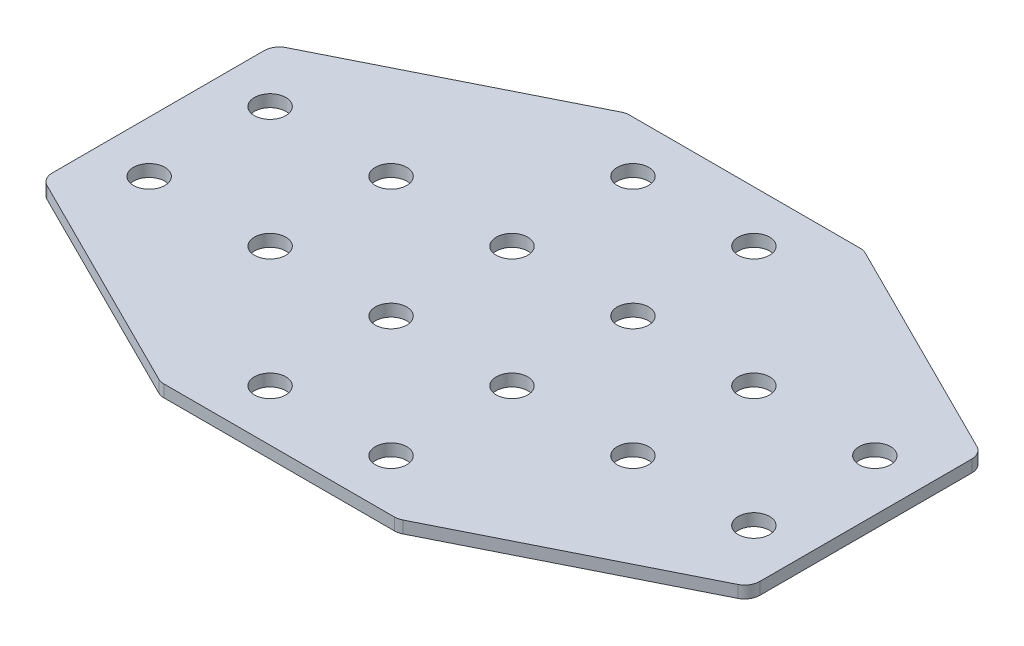
ISO-10303-21;
HEADER;
FILE_DESCRIPTION(('STEP AP214'),'2;1');
FILE_NAME('part.step','',(''),(''),'','','');
FILE_SCHEMA(('AUTOMOTIVE_DESIGN { 1 0 10303 214 1 1 1 1 }'));
ENDSEC;
DATA;
#1=APPLICATION_CONTEXT('core data for automotive mechanical design processes');
#2=APPLICATION_PROTOCOL_DEFINITION('international standard','automotive_design',2000,#1);
#3=PRODUCT_CONTEXT('',#1,'mechanical');
#4=PRODUCT('Part','Part','',(#3));
#5=PRODUCT_RELATED_PRODUCT_CATEGORY('part','',(#4));
#6=PRODUCT_DEFINITION_FORMATION('','',#4);
#7=PRODUCT_DEFINITION_CONTEXT('part definition',#1,'design');
#8=PRODUCT_DEFINITION('design','',#6,#7);
#9=PRODUCT_DEFINITION_SHAPE('','',#8);
#10=(LENGTH_UNIT() NAMED_UNIT(*) SI_UNIT(.MILLI.,.METRE.));
#11=(NAMED_UNIT(*) PLANE_ANGLE_UNIT() SI_UNIT($,.RADIAN.));
#12=(NAMED_UNIT(*) SI_UNIT($,.STERADIAN.) SOLID_ANGLE_UNIT());
#13=UNCERTAINTY_MEASURE_WITH_UNIT(LENGTH_MEASURE(1.E-05),#10,'distance_accuracy_value','');
#14=(GEOMETRIC_REPRESENTATION_CONTEXT(3) GLOBAL_UNCERTAINTY_ASSIGNED_CONTEXT((#13)) GLOBAL_UNIT_ASSIGNED_CONTEXT((#10,
#11,#12)) REPRESENTATION_CONTEXT('',''));
#15=CARTESIAN_POINT('',(0.,0.,0.));
#16=DIRECTION('',(0.,0.,1.));
#17=DIRECTION('',(1.,0.,0.));
#18=AXIS2_PLACEMENT_3D('',#15,#16,#17);
#19=CARTESIAN_POINT('',(-1.85772119630201,2.14126526069458,-1.28303356234483));
#20=DIRECTION('',(0.,-1.,0.));
#21=DIRECTION('',(0.,0.,-1.));
#22=AXIS2_PLACEMENT_3D('',#19,#20,#21);
#23=PLANE('',#22);
#24=CARTESIAN_POINT('',(-11.857721196302,2.14126526069458,8.71696643765519));
#25=DIRECTION('',(0.,-1.,0.));
#26=DIRECTION('',(0.,0.,1.));
#27=AXIS2_PLACEMENT_3D('',#24,#25,#26);
#28=CIRCLE('',#27,2.6);
#29=CARTESIAN_POINT('',(-11.857721196302,2.14126526069458,11.3169664376552));
#30=VERTEX_POINT('',#29);
#31=EDGE_CURVE('E140',#30,#30,#28,.T.);
#32=ORIENTED_EDGE('',*,*,#31,.F.);
#33=EDGE_LOOP('',(#32));
#34=FACE_BOUND('',#33,.T.);
#35=CARTESIAN_POINT('',(-11.857721196302,2.14126526069458,28.7169664376552));
#36=DIRECTION('',(0.,-1.,0.));
#37=DIRECTION('',(0.,0.,1.));
#38=AXIS2_PLACEMENT_3D('',#35,#36,#37);
#39=CIRCLE('',#38,2.6);
#40=CARTESIAN_POINT('',(-11.857721196302,2.14126526069458,31.3169664376552));
#41=VERTEX_POINT('',#40);
#42=EDGE_CURVE('E243',#41,#41,#39,.T.);
#43=ORIENTED_EDGE('',*,*,#42,.F.);
#44=EDGE_LOOP('',(#43));
#45=FACE_BOUND('',#44,.T.);
#46=CARTESIAN_POINT('',(-31.857721196302,2.14126526069458,8.71696643765519));
#47=DIRECTION('',(0.,-1.,0.));
#48=DIRECTION('',(0.,0.,1.));
#49=AXIS2_PLACEMENT_3D('',#46,#47,#48);
#50=CIRCLE('',#49,2.6);
#51=CARTESIAN_POINT('',(-31.857721196302,2.14126526069458,11.3169664376552));
#52=VERTEX_POINT('',#51);
#53=EDGE_CURVE('E237',#52,#52,#50,.T.);
#54=ORIENTED_EDGE('',*,*,#53,.F.);
#55=EDGE_LOOP('',(#54));
#56=FACE_BOUND('',#55,.T.);
#57=CARTESIAN_POINT('',(-51.857721196302,2.14126526069458,8.71696643765517));
#58=DIRECTION('',(0.,-1.,0.));
#59=DIRECTION('',(0.,0.,1.));
#60=AXIS2_PLACEMENT_3D('',#57,#58,#59);
#61=CIRCLE('',#60,2.6);
#62=CARTESIAN_POINT('',(-51.857721196302,2.14126526069458,11.3169664376552));
#63=VERTEX_POINT('',#62);
#64=EDGE_CURVE('E231',#63,#63,#61,.T.);
#65=ORIENTED_EDGE('',*,*,#64,.F.);
#66=EDGE_LOOP('',(#65));
#67=FACE_BOUND('',#66,.T.);
#68=CARTESIAN_POINT('',(8.14227880369796,2.14126526069458,8.71696643765518));
#69=DIRECTION('',(0.,1.,0.));
#70=DIRECTION('',(0.,0.,1.));
#71=AXIS2_PLACEMENT_3D('',#68,#69,#70);
#72=CIRCLE('',#71,2.6);
#73=CARTESIAN_POINT('',(8.14227880369796,2.14126526069458,11.3169664376552));
#74=VERTEX_POINT('',#73);
#75=EDGE_CURVE('E298',#74,#74,#72,.T.);
#76=ORIENTED_EDGE('',*,*,#75,.T.);
#77=EDGE_LOOP('',(#76));
#78=FACE_BOUND('',#77,.T.);
#79=CARTESIAN_POINT('',(8.142278803698,2.14126526069458,28.7169664376552));
#80=DIRECTION('',(0.,1.,0.));
#81=DIRECTION('',(0.,0.,1.));
#82=AXIS2_PLACEMENT_3D('',#79,#80,#81);
#83=CIRCLE('',#82,2.6);
#84=CARTESIAN_POINT('',(8.142278803698,2.14126526069458,31.3169664376552));
#85=VERTEX_POINT('',#84);
#86=EDGE_CURVE('E292',#85,#85,#83,.T.);
#87=ORIENTED_EDGE('',*,*,#86,.T.);
#88=EDGE_LOOP('',(#87));
#89=FACE_BOUND('',#88,.T.);
#90=CARTESIAN_POINT('',(28.142278803698,2.14126526069458,8.71696643765519));
#91=DIRECTION('',(0.,1.,0.));
#92=DIRECTION('',(0.,0.,1.));
#93=AXIS2_PLACEMENT_3D('',#90,#91,#92);
#94=CIRCLE('',#93,2.6);
#95=CARTESIAN_POINT('',(28.142278803698,2.14126526069458,11.3169664376552));
#96=VERTEX_POINT('',#95);
#97=EDGE_CURVE('E286',#96,#96,#94,.T.);
#98=ORIENTED_EDGE('',*,*,#97,.T.);
#99=EDGE_LOOP('',(#98));
#100=FACE_BOUND('',#99,.T.);
#101=CARTESIAN_POINT('',(48.142278803698,2.14126526069458,8.71696643765516));
#102=DIRECTION('',(0.,1.,0.));
#103=DIRECTION('',(0.,0.,1.));
#104=AXIS2_PLACEMENT_3D('',#101,#102,#103);
#105=CIRCLE('',#104,2.6);
#106=CARTESIAN_POINT('',(48.142278803698,2.14126526069458,11.3169664376552));
#107=VERTEX_POINT('',#106);
#108=EDGE_CURVE('E280',#107,#107,#105,.T.);
#109=ORIENTED_EDGE('',*,*,#108,.T.);
#110=EDGE_LOOP('',(#109));
#111=FACE_BOUND('',#110,.T.);
#112=DIRECTION('',(0.,0.,-1.));
#113=VECTOR('',#112,1.);
#114=CARTESIAN_POINT('',(-60.3577211963019,2.14126526069458,17.7899154545304));
#115=LINE('',#114,#113);
#116=CARTESIAN_POINT('',(-60.3577211963019,2.14126526069458,16.2448304826556));
#117=VERTEX_POINT('',#116);
#118=CARTESIAN_POINT('',(-60.3577211963019,2.14126526069458,-18.8108976073453));
#119=VERTEX_POINT('',#118);
#120=EDGE_CURVE('E253',#117,#119,#115,.T.);
#121=ORIENTED_EDGE('',*,*,#120,.T.);
#122=CARTESIAN_POINT('',(-57.8577211963019,2.14126526069458,-18.8108976073453));
#123=DIRECTION('',(0.,-1.,0.));
#124=DIRECTION('',(0.,0.,1.));
#125=AXIS2_PLACEMENT_3D('',#122,#123,#124);
#126=CIRCLE('',#125,2.5);
#127=CARTESIAN_POINT('',(-58.9757551850518,2.14126526069458,-21.0469655848451));
#128=VERTEX_POINT('',#127);
#129=EDGE_CURVE('E148',#119,#128,#126,.T.);
#130=ORIENTED_EDGE('',*,*,#129,.T.);
#131=DIRECTION('',(-0.894427190999916,0.,0.447213595499957));
#132=VECTOR('',#131,1.);
#133=CARTESIAN_POINT('',(-21.5036192300524,2.14126526069458,-39.7830335623448));
#134=LINE('',#133,#132);
#135=CARTESIAN_POINT('',(-22.0314832750528,2.14126526069458,-39.5191015398446));
#136=VERTEX_POINT('',#135);
#137=EDGE_CURVE('E158',#136,#128,#134,.T.);
#138=ORIENTED_EDGE('',*,*,#137,.F.);
#139=CARTESIAN_POINT('',(-20.9134492863029,2.14126526069458,-37.2830335623448));
#140=DIRECTION('',(0.,-1.,0.));
#141=DIRECTION('',(0.,0.,1.));
#142=AXIS2_PLACEMENT_3D('',#139,#140,#141);
#143=CIRCLE('',#142,2.5);
#144=CARTESIAN_POINT('',(-20.9134492863029,2.14126526069458,-39.7830335623448));
#145=VERTEX_POINT('',#144);
#146=EDGE_CURVE('E168',#136,#145,#143,.T.);
#147=ORIENTED_EDGE('',*,*,#146,.T.);
#148=DIRECTION('',(1.,0.,0.));
#149=VECTOR('',#148,1.);
#150=CARTESIAN_POINT('',(-20.3577211963021,2.14126526069458,-39.7830335623448));
#151=LINE('',#150,#149);
#152=CARTESIAN_POINT('',(17.1980068936989,2.14126526069458,-39.7830335623448));
#153=VERTEX_POINT('',#152);
#154=EDGE_CURVE('E198',#145,#153,#151,.T.);
#155=ORIENTED_EDGE('',*,*,#154,.T.);
#156=CARTESIAN_POINT('',(17.1980068936989,2.14126526069458,-37.2830335623448));
#157=DIRECTION('',(0.,1.,0.));
#158=DIRECTION('',(0.,0.,1.));
#159=AXIS2_PLACEMENT_3D('',#156,#157,#158);
#160=CIRCLE('',#159,2.5);
#161=CARTESIAN_POINT('',(18.3160408824488,2.14126526069458,-39.5191015398446));
#162=VERTEX_POINT('',#161);
#163=EDGE_CURVE('E220',#162,#153,#160,.T.);
#164=ORIENTED_EDGE('',*,*,#163,.F.);
#165=DIRECTION('',(0.894427190999916,0.,0.447213595499957));
#166=VECTOR('',#165,1.);
#167=CARTESIAN_POINT('',(17.7881768374484,2.14126526069458,-39.7830335623448));
#168=LINE('',#167,#166);
#169=CARTESIAN_POINT('',(55.2603127924478,2.14126526069458,-21.0469655848451));
#170=VERTEX_POINT('',#169);
#171=EDGE_CURVE('E201',#162,#170,#168,.T.);
#172=ORIENTED_EDGE('',*,*,#171,.T.);
#173=CARTESIAN_POINT('',(54.1422788036979,2.14126526069458,-18.8108976073453));
#174=DIRECTION('',(0.,1.,0.));
#175=DIRECTION('',(0.,0.,1.));
#176=AXIS2_PLACEMENT_3D('',#173,#174,#175);
#177=CIRCLE('',#176,2.5);
#178=CARTESIAN_POINT('',(56.6422788036979,2.14126526069458,-18.8108976073453));
#179=VERTEX_POINT('',#178);
#180=EDGE_CURVE('E217',#179,#170,#177,.T.);
#181=ORIENTED_EDGE('',*,*,#180,.F.);
#182=DIRECTION('',(0.,0.,-1.));
#183=VECTOR('',#182,1.);
#184=CARTESIAN_POINT('',(56.6422788036979,2.14126526069458,17.7899154545304));
#185=LINE('',#184,#183);
#186=CARTESIAN_POINT('',(56.6422788036979,2.14126526069458,16.2448304826556));
#187=VERTEX_POINT('',#186);
#188=EDGE_CURVE('E304',#187,#179,#185,.T.);
#189=ORIENTED_EDGE('',*,*,#188,.F.);
#190=CARTESIAN_POINT('',(54.1422788036979,2.14126526069458,16.2448304826556));
#191=DIRECTION('',(0.,-1.,0.));
#192=DIRECTION('',(0.,0.,-1.));
#193=AXIS2_PLACEMENT_3D('',#190,#191,#192);
#194=CIRCLE('',#193,2.5);
#195=CARTESIAN_POINT('',(55.2603127924478,2.14126526069458,18.4808984601554));
#196=VERTEX_POINT('',#195);
#197=EDGE_CURVE('E31',#187,#196,#194,.T.);
#198=ORIENTED_EDGE('',*,*,#197,.T.);
#199=DIRECTION('',(0.894427190999916,0.,-0.447213595499957));
#200=VECTOR('',#199,1.);
#201=CARTESIAN_POINT('',(17.7881768374484,2.14126526069458,37.2169664376551));
#202=LINE('',#201,#200);
#203=CARTESIAN_POINT('',(18.3160408824488,2.14126526069458,36.9530344151549));
#204=VERTEX_POINT('',#203);
#205=EDGE_CURVE('E309',#204,#196,#202,.T.);
#206=ORIENTED_EDGE('',*,*,#205,.F.);
#207=CARTESIAN_POINT('',(17.1980068936989,2.14126526069458,34.7169664376551));
#208=DIRECTION('',(0.,-1.,0.));
#209=DIRECTION('',(0.,0.,-1.));
#210=AXIS2_PLACEMENT_3D('',#207,#208,#209);
#211=CIRCLE('',#210,2.5);
#212=CARTESIAN_POINT('',(17.1980068936989,2.14126526069458,37.2169664376551));
#213=VERTEX_POINT('',#212);
#214=EDGE_CURVE('E324',#204,#213,#211,.T.);
#215=ORIENTED_EDGE('',*,*,#214,.T.);
#216=DIRECTION('',(1.,0.,0.));
#217=VECTOR('',#216,1.);
#218=CARTESIAN_POINT('',(-20.3577211963021,2.14126526069458,37.2169664376551));
#219=LINE('',#218,#217);
#220=CARTESIAN_POINT('',(-20.9134492863029,2.14126526069458,37.2169664376551));
#221=VERTEX_POINT('',#220);
#222=EDGE_CURVE('E306',#221,#213,#219,.T.);
#223=ORIENTED_EDGE('',*,*,#222,.F.);
#224=CARTESIAN_POINT('',(-20.9134492863029,2.14126526069458,34.7169664376551));
#225=DIRECTION('',(0.,1.,0.));
#226=DIRECTION('',(0.,0.,-1.));
#227=AXIS2_PLACEMENT_3D('',#224,#225,#226);
#228=CIRCLE('',#227,2.5);
#229=CARTESIAN_POINT('',(-22.0314832750528,2.14126526069458,36.9530344151549));
#230=VERTEX_POINT('',#229);
#231=EDGE_CURVE('E270',#230,#221,#228,.T.);
#232=ORIENTED_EDGE('',*,*,#231,.F.);
#233=DIRECTION('',(-0.894427190999916,0.,-0.447213595499957));
#234=VECTOR('',#233,1.);
#235=CARTESIAN_POINT('',(-21.5036192300524,2.14126526069458,37.2169664376551));
#236=LINE('',#235,#234);
#237=CARTESIAN_POINT('',(-58.9757551850518,2.14126526069458,18.4808984601554));
#238=VERTEX_POINT('',#237);
#239=EDGE_CURVE('E255',#230,#238,#236,.T.);
#240=ORIENTED_EDGE('',*,*,#239,.T.);
#241=CARTESIAN_POINT('',(-57.8577211963019,2.14126526069458,16.2448304826556));
#242=DIRECTION('',(0.,1.,0.));
#243=DIRECTION('',(0.,0.,-1.));
#244=AXIS2_PLACEMENT_3D('',#241,#242,#243);
#245=CIRCLE('',#244,2.5);
#246=EDGE_CURVE('E267',#117,#238,#245,.T.);
#247=ORIENTED_EDGE('',*,*,#246,.F.);
#248=EDGE_LOOP('',(#121,#130,#138,#147,#155,#164,#172,#181,#189,#198,#206,#215,#223,#232,#240,#247));
#249=FACE_BOUND('',#248,.T.);
#250=CARTESIAN_POINT('',(-11.857721196302,2.14126526069458,-11.2830335623448));
#251=DIRECTION('',(0.,1.,0.));
#252=DIRECTION('',(0.,0.,-1.));
#253=AXIS2_PLACEMENT_3D('',#250,#251,#252);
#254=CIRCLE('',#253,2.6);
#255=CARTESIAN_POINT('',(-11.857721196302,2.14126526069458,-13.8830335623448));
#256=VERTEX_POINT('',#255);
#257=EDGE_CURVE('E352',#256,#256,#254,.T.);
#258=ORIENTED_EDGE('',*,*,#257,.T.);
#259=EDGE_LOOP('',(#258));
#260=FACE_BOUND('',#259,.T.);
#261=CARTESIAN_POINT('',(-11.857721196302,2.14126526069458,-31.2830335623448));
#262=DIRECTION('',(0.,1.,0.));
#263=DIRECTION('',(0.,0.,-1.));
#264=AXIS2_PLACEMENT_3D('',#261,#262,#263);
#265=CIRCLE('',#264,2.6);
#266=CARTESIAN_POINT('',(-11.857721196302,2.14126526069458,-33.8830335623448));
#267=VERTEX_POINT('',#266);
#268=EDGE_CURVE('E356',#267,#267,#265,.T.);
#269=ORIENTED_EDGE('',*,*,#268,.T.);
#270=EDGE_LOOP('',(#269));
#271=FACE_BOUND('',#270,.T.);
#272=CARTESIAN_POINT('',(-31.857721196302,2.14126526069458,-11.2830335623448));
#273=DIRECTION('',(0.,1.,0.));
#274=DIRECTION('',(0.,0.,-1.));
#275=AXIS2_PLACEMENT_3D('',#272,#273,#274);
#276=CIRCLE('',#275,2.6);
#277=CARTESIAN_POINT('',(-31.857721196302,2.14126526069458,-13.8830335623448));
#278=VERTEX_POINT('',#277);
#279=EDGE_CURVE('E360',#278,#278,#276,.T.);
#280=ORIENTED_EDGE('',*,*,#279,.T.);
#281=EDGE_LOOP('',(#280));
#282=FACE_BOUND('',#281,.T.);
#283=CARTESIAN_POINT('',(-51.857721196302,2.14126526069458,-11.2830335623448));
#284=DIRECTION('',(0.,1.,0.));
#285=DIRECTION('',(0.,0.,-1.));
#286=AXIS2_PLACEMENT_3D('',#283,#284,#285);
#287=CIRCLE('',#286,2.6);
#288=CARTESIAN_POINT('',(-51.857721196302,2.14126526069458,-13.8830335623448));
#289=VERTEX_POINT('',#288);
#290=EDGE_CURVE('E364',#289,#289,#287,.T.);
#291=ORIENTED_EDGE('',*,*,#290,.T.);
#292=EDGE_LOOP('',(#291));
#293=FACE_BOUND('',#292,.T.);
#294=CARTESIAN_POINT('',(8.14227880369796,2.14126526069458,-11.2830335623448));
#295=DIRECTION('',(0.,-1.,0.));
#296=DIRECTION('',(0.,0.,-1.));
#297=AXIS2_PLACEMENT_3D('',#294,#295,#296);
#298=CIRCLE('',#297,2.6);
#299=CARTESIAN_POINT('',(8.14227880369796,2.14126526069458,-13.8830335623448));
#300=VERTEX_POINT('',#299);
#301=EDGE_CURVE('E192',#300,#300,#298,.T.);
#302=ORIENTED_EDGE('',*,*,#301,.F.);
#303=EDGE_LOOP('',(#302));
#304=FACE_BOUND('',#303,.T.);
#305=CARTESIAN_POINT('',(8.142278803698,2.14126526069458,-31.2830335623448));
#306=DIRECTION('',(0.,-1.,0.));
#307=DIRECTION('',(0.,0.,-1.));
#308=AXIS2_PLACEMENT_3D('',#305,#306,#307);
#309=CIRCLE('',#308,2.6);
#310=CARTESIAN_POINT('',(8.142278803698,2.14126526069458,-33.8830335623448));
#311=VERTEX_POINT('',#310);
#312=EDGE_CURVE('E186',#311,#311,#309,.T.);
#313=ORIENTED_EDGE('',*,*,#312,.F.);
#314=EDGE_LOOP('',(#313));
#315=FACE_BOUND('',#314,.T.);
#316=CARTESIAN_POINT('',(28.142278803698,2.14126526069458,-11.2830335623448));
#317=DIRECTION('',(0.,-1.,0.));
#318=DIRECTION('',(0.,0.,-1.));
#319=AXIS2_PLACEMENT_3D('',#316,#317,#318);
#320=CIRCLE('',#319,2.6);
#321=CARTESIAN_POINT('',(28.142278803698,2.14126526069458,-13.8830335623448));
#322=VERTEX_POINT('',#321);
#323=EDGE_CURVE('E180',#322,#322,#320,.T.);
#324=ORIENTED_EDGE('',*,*,#323,.F.);
#325=EDGE_LOOP('',(#324));
#326=FACE_BOUND('',#325,.T.);
#327=CARTESIAN_POINT('',(48.142278803698,2.14126526069458,-11.2830335623448));
#328=DIRECTION('',(0.,-1.,0.));
#329=DIRECTION('',(0.,0.,-1.));
#330=AXIS2_PLACEMENT_3D('',#327,#328,#329);
#331=CIRCLE('',#330,2.6);
#332=CARTESIAN_POINT('',(48.142278803698,2.14126526069458,-13.8830335623448));
#333=VERTEX_POINT('',#332);
#334=EDGE_CURVE('E174',#333,#333,#331,.T.);
#335=ORIENTED_EDGE('',*,*,#334,.F.);
#336=EDGE_LOOP('',(#335));
#337=FACE_BOUND('',#336,.T.);
#338=ADVANCED_FACE('F16',(#34,#45,#56,#67,#78,#89,#100,#111,#249,#260,#271,#282,#293,#304,#315,
#326,#337),#23,.T.);
#339=CARTESIAN_POINT('',(56.6422788036979,2.14126526069458,17.7899154545304));
#340=DIRECTION('',(1.,0.,0.));
#341=DIRECTION('',(0.,0.,-1.));
#342=AXIS2_PLACEMENT_3D('',#339,#340,#341);
#343=PLANE('',#342);
#344=ORIENTED_EDGE('',*,*,#188,.T.);
#345=DIRECTION('',(0.,1.,0.));
#346=VECTOR('',#345,1.);
#347=CARTESIAN_POINT('',(56.6422788036979,2.14126526069458,-18.8108976073453));
#348=LINE('',#347,#346);
#349=CARTESIAN_POINT('',(56.6422788036979,4.14126526069458,-18.8108976073453));
#350=VERTEX_POINT('',#349);
#351=EDGE_CURVE('E227',#350,#179,#348,.F.);
#352=ORIENTED_EDGE('',*,*,#351,.F.);
#353=DIRECTION('',(0.,0.,-1.));
#354=VECTOR('',#353,1.);
#355=CARTESIAN_POINT('',(56.6422788036979,4.14126526069458,17.7899154545304));
#356=LINE('',#355,#354);
#357=CARTESIAN_POINT('',(56.6422788036979,4.14126526069458,16.2448304826556));
#358=VERTEX_POINT('',#357);
#359=EDGE_CURVE('E301',#358,#350,#356,.T.);
#360=ORIENTED_EDGE('',*,*,#359,.F.);
#361=DIRECTION('',(0.,1.,0.));
#362=VECTOR('',#361,1.);
#363=CARTESIAN_POINT('',(56.6422788036979,2.14126526069458,16.2448304826556));
#364=LINE('',#363,#362);
#365=EDGE_CURVE('E10',#358,#187,#364,.F.);
#366=ORIENTED_EDGE('',*,*,#365,.T.);
#367=EDGE_LOOP('',(#344,#352,#360,#366));
#368=FACE_BOUND('',#367,.T.);
#369=ADVANCED_FACE('F346',(#368),#343,.T.);
#370=CARTESIAN_POINT('',(-1.85772119630201,4.14126526069458,-1.28303356234483));
#371=DIRECTION('',(0.,-1.,0.));
#372=DIRECTION('',(0.,0.,-1.));
#373=AXIS2_PLACEMENT_3D('',#370,#371,#372);
#374=PLANE('',#373);
#375=CARTESIAN_POINT('',(-11.857721196302,4.14126526069458,8.71696643765519));
#376=DIRECTION('',(0.,-1.,0.));
#377=DIRECTION('',(0.,0.,1.));
#378=AXIS2_PLACEMENT_3D('',#375,#376,#377);
#379=CIRCLE('',#378,2.6);
#380=CARTESIAN_POINT('',(-11.857721196302,4.14126526069458,11.3169664376552));
#381=VERTEX_POINT('',#380);
#382=EDGE_CURVE('E246',#381,#381,#379,.T.);
#383=ORIENTED_EDGE('',*,*,#382,.T.);
#384=EDGE_LOOP('',(#383));
#385=FACE_BOUND('',#384,.T.);
#386=CARTESIAN_POINT('',(-11.857721196302,4.14126526069458,28.7169664376552));
#387=DIRECTION('',(0.,-1.,0.));
#388=DIRECTION('',(0.,0.,1.));
#389=AXIS2_PLACEMENT_3D('',#386,#387,#388);
#390=CIRCLE('',#389,2.6);
#391=CARTESIAN_POINT('',(-11.857721196302,4.14126526069458,31.3169664376552));
#392=VERTEX_POINT('',#391);
#393=EDGE_CURVE('E240',#392,#392,#390,.T.);
#394=ORIENTED_EDGE('',*,*,#393,.T.);
#395=EDGE_LOOP('',(#394));
#396=FACE_BOUND('',#395,.T.);
#397=CARTESIAN_POINT('',(-31.857721196302,4.14126526069458,8.71696643765519));
#398=DIRECTION('',(0.,-1.,0.));
#399=DIRECTION('',(0.,0.,1.));
#400=AXIS2_PLACEMENT_3D('',#397,#398,#399);
#401=CIRCLE('',#400,2.6);
#402=CARTESIAN_POINT('',(-31.857721196302,4.14126526069458,11.3169664376552));
#403=VERTEX_POINT('',#402);
#404=EDGE_CURVE('E234',#403,#403,#401,.T.);
#405=ORIENTED_EDGE('',*,*,#404,.T.);
#406=EDGE_LOOP('',(#405));
#407=FACE_BOUND('',#406,.T.);
#408=CARTESIAN_POINT('',(-51.857721196302,4.14126526069458,8.71696643765517));
#409=DIRECTION('',(0.,-1.,0.));
#410=DIRECTION('',(0.,0.,1.));
#411=AXIS2_PLACEMENT_3D('',#408,#409,#410);
#412=CIRCLE('',#411,2.6);
#413=CARTESIAN_POINT('',(-51.857721196302,4.14126526069458,11.3169664376552));
#414=VERTEX_POINT('',#413);
#415=EDGE_CURVE('E230',#414,#414,#412,.T.);
#416=ORIENTED_EDGE('',*,*,#415,.T.);
#417=EDGE_LOOP('',(#416));
#418=FACE_BOUND('',#417,.T.);
#419=CARTESIAN_POINT('',(8.14227880369796,4.14126526069458,8.71696643765518));
#420=DIRECTION('',(0.,1.,0.));
#421=DIRECTION('',(0.,0.,1.));
#422=AXIS2_PLACEMENT_3D('',#419,#420,#421);
#423=CIRCLE('',#422,2.6);
#424=CARTESIAN_POINT('',(8.14227880369796,4.14126526069458,11.3169664376552));
#425=VERTEX_POINT('',#424);
#426=EDGE_CURVE('E295',#425,#425,#423,.T.);
#427=ORIENTED_EDGE('',*,*,#426,.F.);
#428=EDGE_LOOP('',(#427));
#429=FACE_BOUND('',#428,.T.);
#430=CARTESIAN_POINT('',(8.142278803698,4.14126526069458,28.7169664376552));
#431=DIRECTION('',(0.,1.,0.));
#432=DIRECTION('',(0.,0.,1.));
#433=AXIS2_PLACEMENT_3D('',#430,#431,#432);
#434=CIRCLE('',#433,2.6);
#435=CARTESIAN_POINT('',(8.142278803698,4.14126526069458,31.3169664376552));
#436=VERTEX_POINT('',#435);
#437=EDGE_CURVE('E289',#436,#436,#434,.T.);
#438=ORIENTED_EDGE('',*,*,#437,.F.);
#439=EDGE_LOOP('',(#438));
#440=FACE_BOUND('',#439,.T.);
#441=CARTESIAN_POINT('',(28.142278803698,4.14126526069458,8.71696643765519));
#442=DIRECTION('',(0.,1.,0.));
#443=DIRECTION('',(0.,0.,1.));
#444=AXIS2_PLACEMENT_3D('',#441,#442,#443);
#445=CIRCLE('',#444,2.6);
#446=CARTESIAN_POINT('',(28.142278803698,4.14126526069458,11.3169664376552));
#447=VERTEX_POINT('',#446);
#448=EDGE_CURVE('E283',#447,#447,#445,.T.);
#449=ORIENTED_EDGE('',*,*,#448,.F.);
#450=EDGE_LOOP('',(#449));
#451=FACE_BOUND('',#450,.T.);
#452=CARTESIAN_POINT('',(48.142278803698,4.14126526069458,8.71696643765516));
#453=DIRECTION('',(0.,1.,0.));
#454=DIRECTION('',(0.,0.,1.));
#455=AXIS2_PLACEMENT_3D('',#452,#453,#454);
#456=CIRCLE('',#455,2.6);
#457=CARTESIAN_POINT('',(48.142278803698,4.14126526069458,11.3169664376552));
#458=VERTEX_POINT('',#457);
#459=EDGE_CURVE('E279',#458,#458,#456,.T.);
#460=ORIENTED_EDGE('',*,*,#459,.F.);
#461=EDGE_LOOP('',(#460));
#462=FACE_BOUND('',#461,.T.);
#463=ORIENTED_EDGE('',*,*,#359,.T.);
#464=CARTESIAN_POINT('',(54.1422788036979,4.14126526069458,-18.8108976073453));
#465=DIRECTION('',(0.,1.,0.));
#466=DIRECTION('',(0.,0.,1.));
#467=AXIS2_PLACEMENT_3D('',#464,#465,#466);
#468=CIRCLE('',#467,2.5);
#469=CARTESIAN_POINT('',(55.2603127924478,4.14126526069458,-21.0469655848451));
#470=VERTEX_POINT('',#469);
#471=EDGE_CURVE('E205',#470,#350,#468,.F.);
#472=ORIENTED_EDGE('',*,*,#471,.F.);
#473=DIRECTION('',(0.894427190999916,0.,0.447213595499957));
#474=VECTOR('',#473,1.);
#475=CARTESIAN_POINT('',(17.7881768374484,4.14126526069458,-39.7830335623448));
#476=LINE('',#475,#474);
#477=CARTESIAN_POINT('',(18.3160408824488,4.14126526069458,-39.5191015398446));
#478=VERTEX_POINT('',#477);
#479=EDGE_CURVE('E202',#478,#470,#476,.T.);
#480=ORIENTED_EDGE('',*,*,#479,.F.);
#481=CARTESIAN_POINT('',(17.1980068936989,4.14126526069458,-37.2830335623448));
#482=DIRECTION('',(0.,1.,0.));
#483=DIRECTION('',(0.,0.,1.));
#484=AXIS2_PLACEMENT_3D('',#481,#482,#483);
#485=CIRCLE('',#484,2.5);
#486=CARTESIAN_POINT('',(17.1980068936989,4.14126526069458,-39.7830335623448));
#487=VERTEX_POINT('',#486);
#488=EDGE_CURVE('E212',#487,#478,#485,.F.);
#489=ORIENTED_EDGE('',*,*,#488,.F.);
#490=DIRECTION('',(1.,0.,0.));
#491=VECTOR('',#490,1.);
#492=CARTESIAN_POINT('',(-20.3577211963021,4.14126526069458,-39.7830335623448));
#493=LINE('',#492,#491);
#494=CARTESIAN_POINT('',(-20.9134492863029,4.14126526069458,-39.7830335623448));
#495=VERTEX_POINT('',#494);
#496=EDGE_CURVE('E195',#495,#487,#493,.T.);
#497=ORIENTED_EDGE('',*,*,#496,.F.);
#498=CARTESIAN_POINT('',(-20.9134492863029,4.14126526069458,-37.2830335623448));
#499=DIRECTION('',(0.,-1.,0.));
#500=DIRECTION('',(0.,0.,1.));
#501=AXIS2_PLACEMENT_3D('',#498,#499,#500);
#502=CIRCLE('',#501,2.5);
#503=CARTESIAN_POINT('',(-22.0314832750528,4.14126526069458,-39.5191015398446));
#504=VERTEX_POINT('',#503);
#505=EDGE_CURVE('E157',#495,#504,#502,.F.);
#506=ORIENTED_EDGE('',*,*,#505,.T.);
#507=DIRECTION('',(-0.894427190999916,0.,0.447213595499957));
#508=VECTOR('',#507,1.);
#509=CARTESIAN_POINT('',(-21.5036192300524,4.14126526069458,-39.7830335623448));
#510=LINE('',#509,#508);
#511=CARTESIAN_POINT('',(-58.9757551850518,4.14126526069458,-21.0469655848451));
#512=VERTEX_POINT('',#511);
#513=EDGE_CURVE('E156',#504,#512,#510,.T.);
#514=ORIENTED_EDGE('',*,*,#513,.T.);
#515=CARTESIAN_POINT('',(-57.8577211963019,4.14126526069458,-18.8108976073453));
#516=DIRECTION('',(0.,-1.,0.));
#517=DIRECTION('',(0.,0.,1.));
#518=AXIS2_PLACEMENT_3D('',#515,#516,#517);
#519=CIRCLE('',#518,2.5);
#520=CARTESIAN_POINT('',(-60.3577211963019,4.14126526069458,-18.8108976073453));
#521=VERTEX_POINT('',#520);
#522=EDGE_CURVE('E145',#512,#521,#519,.F.);
#523=ORIENTED_EDGE('',*,*,#522,.T.);
#524=DIRECTION('',(0.,0.,-1.));
#525=VECTOR('',#524,1.);
#526=CARTESIAN_POINT('',(-60.3577211963019,4.14126526069458,17.7899154545304));
#527=LINE('',#526,#525);
#528=CARTESIAN_POINT('',(-60.3577211963019,4.14126526069458,16.2448304826556));
#529=VERTEX_POINT('',#528);
#530=EDGE_CURVE('E130',#529,#521,#527,.T.);
#531=ORIENTED_EDGE('',*,*,#530,.F.);
#532=CARTESIAN_POINT('',(-57.8577211963019,4.14126526069458,16.2448304826556));
#533=DIRECTION('',(0.,1.,0.));
#534=DIRECTION('',(0.,0.,-1.));
#535=AXIS2_PLACEMENT_3D('',#532,#533,#534);
#536=CIRCLE('',#535,2.5);
#537=CARTESIAN_POINT('',(-58.9757551850518,4.14126526069458,18.4808984601554));
#538=VERTEX_POINT('',#537);
#539=EDGE_CURVE('E257',#538,#529,#536,.F.);
#540=ORIENTED_EDGE('',*,*,#539,.F.);
#541=DIRECTION('',(-0.894427190999916,0.,-0.447213595499957));
#542=VECTOR('',#541,1.);
#543=CARTESIAN_POINT('',(-21.5036192300524,4.14126526069458,37.2169664376551));
#544=LINE('',#543,#542);
#545=CARTESIAN_POINT('',(-22.0314832750528,4.14126526069458,36.9530344151549));
#546=VERTEX_POINT('',#545);
#547=EDGE_CURVE('E139',#546,#538,#544,.T.);
#548=ORIENTED_EDGE('',*,*,#547,.F.);
#549=CARTESIAN_POINT('',(-20.9134492863029,4.14126526069458,34.7169664376551));
#550=DIRECTION('',(0.,1.,0.));
#551=DIRECTION('',(0.,0.,-1.));
#552=AXIS2_PLACEMENT_3D('',#549,#550,#551);
#553=CIRCLE('',#552,2.5);
#554=CARTESIAN_POINT('',(-20.9134492863029,4.14126526069458,37.2169664376551));
#555=VERTEX_POINT('',#554);
#556=EDGE_CURVE('E262',#555,#546,#553,.F.);
#557=ORIENTED_EDGE('',*,*,#556,.F.);
#558=DIRECTION('',(1.,0.,0.));
#559=VECTOR('',#558,1.);
#560=CARTESIAN_POINT('',(-20.3577211963021,4.14126526069458,37.2169664376551));
#561=LINE('',#560,#559);
#562=CARTESIAN_POINT('',(17.1980068936989,4.14126526069458,37.2169664376551));
#563=VERTEX_POINT('',#562);
#564=EDGE_CURVE('E313',#555,#563,#561,.T.);
#565=ORIENTED_EDGE('',*,*,#564,.T.);
#566=CARTESIAN_POINT('',(17.1980068936989,4.14126526069458,34.7169664376551));
#567=DIRECTION('',(0.,-1.,0.));
#568=DIRECTION('',(0.,0.,-1.));
#569=AXIS2_PLACEMENT_3D('',#566,#567,#568);
#570=CIRCLE('',#569,2.5);
#571=CARTESIAN_POINT('',(18.3160408824488,4.14126526069458,36.9530344151549));
#572=VERTEX_POINT('',#571);
#573=EDGE_CURVE('E318',#563,#572,#570,.F.);
#574=ORIENTED_EDGE('',*,*,#573,.T.);
#575=DIRECTION('',(0.894427190999916,0.,-0.447213595499957));
#576=VECTOR('',#575,1.);
#577=CARTESIAN_POINT('',(17.7881768374484,4.14126526069458,37.2169664376551));
#578=LINE('',#577,#576);
#579=CARTESIAN_POINT('',(55.2603127924478,4.14126526069458,18.4808984601554));
#580=VERTEX_POINT('',#579);
#581=EDGE_CURVE('E307',#572,#580,#578,.T.);
#582=ORIENTED_EDGE('',*,*,#581,.T.);
#583=CARTESIAN_POINT('',(54.1422788036979,4.14126526069458,16.2448304826556));
#584=DIRECTION('',(0.,-1.,0.));
#585=DIRECTION('',(0.,0.,-1.));
#586=AXIS2_PLACEMENT_3D('',#583,#584,#585);
#587=CIRCLE('',#586,2.5);
#588=EDGE_CURVE('E311',#580,#358,#587,.F.);
#589=ORIENTED_EDGE('',*,*,#588,.T.);
#590=EDGE_LOOP('',(#463,#472,#480,#489,#497,#506,#514,#523,#531,#540,#548,#557,#565,#574,#582,#589));
#591=FACE_BOUND('',#590,.T.);
#592=CARTESIAN_POINT('',(-11.857721196302,4.14126526069458,-11.2830335623448));
#593=DIRECTION('',(0.,1.,0.));
#594=DIRECTION('',(0.,0.,-1.));
#595=AXIS2_PLACEMENT_3D('',#592,#593,#594);
#596=CIRCLE('',#595,2.6);
#597=CARTESIAN_POINT('',(-11.857721196302,4.14126526069458,-13.8830335623448));
#598=VERTEX_POINT('',#597);
#599=EDGE_CURVE('E515',#598,#598,#596,.T.);
#600=ORIENTED_EDGE('',*,*,#599,.F.);
#601=EDGE_LOOP('',(#600));
#602=FACE_BOUND('',#601,.T.);
#603=CARTESIAN_POINT('',(-11.857721196302,4.14126526069458,-31.2830335623448));
#604=DIRECTION('',(0.,1.,0.));
#605=DIRECTION('',(0.,0.,-1.));
#606=AXIS2_PLACEMENT_3D('',#603,#604,#605);
#607=CIRCLE('',#606,2.6);
#608=CARTESIAN_POINT('',(-11.857721196302,4.14126526069458,-33.8830335623448));
#609=VERTEX_POINT('',#608);
#610=EDGE_CURVE('E511',#609,#609,#607,.T.);
#611=ORIENTED_EDGE('',*,*,#610,.F.);
#612=EDGE_LOOP('',(#611));
#613=FACE_BOUND('',#612,.T.);
#614=CARTESIAN_POINT('',(-31.857721196302,4.14126526069458,-11.2830335623448));
#615=DIRECTION('',(0.,1.,0.));
#616=DIRECTION('',(0.,0.,-1.));
#617=AXIS2_PLACEMENT_3D('',#614,#615,#616);
#618=CIRCLE('',#617,2.6);
#619=CARTESIAN_POINT('',(-31.857721196302,4.14126526069458,-13.8830335623448));
#620=VERTEX_POINT('',#619);
#621=EDGE_CURVE('E507',#620,#620,#618,.T.);
#622=ORIENTED_EDGE('',*,*,#621,.F.);
#623=EDGE_LOOP('',(#622));
#624=FACE_BOUND('',#623,.T.);
#625=CARTESIAN_POINT('',(-51.857721196302,4.14126526069458,-11.2830335623448));
#626=DIRECTION('',(0.,1.,0.));
#627=DIRECTION('',(0.,0.,-1.));
#628=AXIS2_PLACEMENT_3D('',#625,#626,#627);
#629=CIRCLE('',#628,2.6);
#630=CARTESIAN_POINT('',(-51.857721196302,4.14126526069458,-13.8830335623448));
#631=VERTEX_POINT('',#630);
#632=EDGE_CURVE('E504',#631,#631,#629,.T.);
#633=ORIENTED_EDGE('',*,*,#632,.F.);
#634=EDGE_LOOP('',(#633));
#635=FACE_BOUND('',#634,.T.);
#636=CARTESIAN_POINT('',(8.14227880369796,4.14126526069458,-11.2830335623448));
#637=DIRECTION('',(0.,-1.,0.));
#638=DIRECTION('',(0.,0.,-1.));
#639=AXIS2_PLACEMENT_3D('',#636,#637,#638);
#640=CIRCLE('',#639,2.6);
#641=CARTESIAN_POINT('',(8.14227880369796,4.14126526069458,-13.8830335623448));
#642=VERTEX_POINT('',#641);
#643=EDGE_CURVE('E189',#642,#642,#640,.T.);
#644=ORIENTED_EDGE('',*,*,#643,.T.);
#645=EDGE_LOOP('',(#644));
#646=FACE_BOUND('',#645,.T.);
#647=CARTESIAN_POINT('',(8.142278803698,4.14126526069458,-31.2830335623448));
#648=DIRECTION('',(0.,-1.,0.));
#649=DIRECTION('',(0.,0.,-1.));
#650=AXIS2_PLACEMENT_3D('',#647,#648,#649);
#651=CIRCLE('',#650,2.6);
#652=CARTESIAN_POINT('',(8.142278803698,4.14126526069458,-33.8830335623448));
#653=VERTEX_POINT('',#652);
#654=EDGE_CURVE('E183',#653,#653,#651,.T.);
#655=ORIENTED_EDGE('',*,*,#654,.T.);
#656=EDGE_LOOP('',(#655));
#657=FACE_BOUND('',#656,.T.);
#658=CARTESIAN_POINT('',(28.142278803698,4.14126526069458,-11.2830335623448));
#659=DIRECTION('',(0.,-1.,0.));
#660=DIRECTION('',(0.,0.,-1.));
#661=AXIS2_PLACEMENT_3D('',#658,#659,#660);
#662=CIRCLE('',#661,2.6);
#663=CARTESIAN_POINT('',(28.142278803698,4.14126526069458,-13.8830335623448));
#664=VERTEX_POINT('',#663);
#665=EDGE_CURVE('E177',#664,#664,#662,.T.);
#666=ORIENTED_EDGE('',*,*,#665,.T.);
#667=EDGE_LOOP('',(#666));
#668=FACE_BOUND('',#667,.T.);
#669=CARTESIAN_POINT('',(48.142278803698,4.14126526069458,-11.2830335623448));
#670=DIRECTION('',(0.,-1.,0.));
#671=DIRECTION('',(0.,0.,-1.));
#672=AXIS2_PLACEMENT_3D('',#669,#670,#671);
#673=CIRCLE('',#672,2.6);
#674=CARTESIAN_POINT('',(48.142278803698,4.14126526069458,-13.8830335623448));
#675=VERTEX_POINT('',#674);
#676=EDGE_CURVE('E149',#675,#675,#673,.T.);
#677=ORIENTED_EDGE('',*,*,#676,.T.);
#678=EDGE_LOOP('',(#677));
#679=FACE_BOUND('',#678,.T.);
#680=ADVANCED_FACE('F152',(#385,#396,#407,#418,#429,#440,#451,#462,#591,#602,#613,#624,#635,
#646,#657,#668,#679),#374,.F.);
#681=CARTESIAN_POINT('',(-60.3577211963019,2.14126526069458,17.7899154545304));
#682=DIRECTION('',(-1.,0.,0.));
#683=DIRECTION('',(0.,0.,-1.));
#684=AXIS2_PLACEMENT_3D('',#681,#682,#683);
#685=PLANE('',#684);
#686=ORIENTED_EDGE('',*,*,#530,.T.);
#687=DIRECTION('',(0.,1.,0.));
#688=VECTOR('',#687,1.);
#689=CARTESIAN_POINT('',(-60.3577211963019,2.14126526069458,-18.8108976073453));
#690=LINE('',#689,#688);
#691=EDGE_CURVE('E134',#521,#119,#690,.F.);
#692=ORIENTED_EDGE('',*,*,#691,.T.);
#693=ORIENTED_EDGE('',*,*,#120,.F.);
#694=DIRECTION('',(0.,1.,0.));
#695=VECTOR('',#694,1.);
#696=CARTESIAN_POINT('',(-60.3577211963019,2.14126526069458,16.2448304826556));
#697=LINE('',#696,#695);
#698=EDGE_CURVE('E136',#529,#117,#697,.F.);
#699=ORIENTED_EDGE('',*,*,#698,.F.);
#700=EDGE_LOOP('',(#686,#692,#693,#699));
#701=FACE_BOUND('',#700,.T.);
#702=ADVANCED_FACE('F132',(#701),#685,.T.);
#703=CARTESIAN_POINT('',(17.7881768374484,2.14126526069458,37.2169664376551));
#704=DIRECTION('',(0.447213595499957,0.,0.894427190999916));
#705=DIRECTION('',(0.894427190999916,0.,-0.447213595499958));
#706=AXIS2_PLACEMENT_3D('',#703,#704,#705);
#707=PLANE('',#706);
#708=ORIENTED_EDGE('',*,*,#581,.F.);
#709=DIRECTION('',(0.,1.,0.));
#710=VECTOR('',#709,1.);
#711=CARTESIAN_POINT('',(18.3160408824488,2.14126526069458,36.9530344151549));
#712=LINE('',#711,#710);
#713=EDGE_CURVE('E24',#572,#204,#712,.F.);
#714=ORIENTED_EDGE('',*,*,#713,.T.);
#715=ORIENTED_EDGE('',*,*,#205,.T.);
#716=DIRECTION('',(0.,1.,0.));
#717=VECTOR('',#716,1.);
#718=CARTESIAN_POINT('',(55.2603127924478,2.14126526069458,18.4808984601554));
#719=LINE('',#718,#717);
#720=EDGE_CURVE('E327',#196,#580,#719,.T.);
#721=ORIENTED_EDGE('',*,*,#720,.T.);
#722=EDGE_LOOP('',(#708,#714,#715,#721));
#723=FACE_BOUND('',#722,.T.);
#724=ADVANCED_FACE('F330',(#723),#707,.T.);
#725=CARTESIAN_POINT('',(-20.3577211963021,2.14126526069458,37.2169664376551));
#726=DIRECTION('',(0.,0.,1.));
#727=DIRECTION('',(1.,0.,0.));
#728=AXIS2_PLACEMENT_3D('',#725,#726,#727);
#729=PLANE('',#728);
#730=ORIENTED_EDGE('',*,*,#564,.F.);
#731=DIRECTION('',(0.,1.,0.));
#732=VECTOR('',#731,1.);
#733=CARTESIAN_POINT('',(-20.9134492863029,2.14126526069458,37.2169664376551));
#734=LINE('',#733,#732);
#735=EDGE_CURVE('E264',#221,#555,#734,.T.);
#736=ORIENTED_EDGE('',*,*,#735,.F.);
#737=ORIENTED_EDGE('',*,*,#222,.T.);
#738=DIRECTION('',(0.,1.,0.));
#739=VECTOR('',#738,1.);
#740=CARTESIAN_POINT('',(17.1980068936989,2.14126526069458,37.2169664376551));
#741=LINE('',#740,#739);
#742=EDGE_CURVE('E320',#213,#563,#741,.T.);
#743=ORIENTED_EDGE('',*,*,#742,.T.);
#744=EDGE_LOOP('',(#730,#736,#737,#743));
#745=FACE_BOUND('',#744,.T.);
#746=ADVANCED_FACE('F340',(#745),#729,.T.);
#747=CARTESIAN_POINT('',(17.1980068936989,2.14126526069458,34.7169664376551));
#748=DIRECTION('',(0.,1.,0.));
#749=DIRECTION('',(0.,0.,1.));
#750=AXIS2_PLACEMENT_3D('',#747,#748,#749);
#751=CYLINDRICAL_SURFACE('',#750,2.5);
#752=ORIENTED_EDGE('',*,*,#214,.F.);
#753=ORIENTED_EDGE('',*,*,#713,.F.);
#754=ORIENTED_EDGE('',*,*,#573,.F.);
#755=ORIENTED_EDGE('',*,*,#742,.F.);
#756=EDGE_LOOP('',(#752,#753,#754,#755));
#757=FACE_BOUND('',#756,.T.);
#758=ADVANCED_FACE('F338',(#757),#751,.T.);
#759=CARTESIAN_POINT('',(54.1422788036979,2.14126526069458,16.2448304826556));
#760=DIRECTION('',(0.,1.,0.));
#761=DIRECTION('',(0.,0.,1.));
#762=AXIS2_PLACEMENT_3D('',#759,#760,#761);
#763=CYLINDRICAL_SURFACE('',#762,2.5);
#764=ORIENTED_EDGE('',*,*,#197,.F.);
#765=ORIENTED_EDGE('',*,*,#365,.F.);
#766=ORIENTED_EDGE('',*,*,#588,.F.);
#767=ORIENTED_EDGE('',*,*,#720,.F.);
#768=EDGE_LOOP('',(#764,#765,#766,#767));
#769=FACE_BOUND('',#768,.T.);
#770=ADVANCED_FACE('F18',(#769),#763,.T.);
#771=CARTESIAN_POINT('',(8.14227880369796,2.14126526069458,8.71696643765518));
#772=DIRECTION('',(0.,1.,0.));
#773=DIRECTION('',(0.,0.,1.));
#774=AXIS2_PLACEMENT_3D('',#771,#772,#773);
#775=CYLINDRICAL_SURFACE('',#774,2.6);
#776=ORIENTED_EDGE('',*,*,#75,.F.);
#777=EDGE_LOOP('',(#776));
#778=FACE_BOUND('',#777,.T.);
#779=ORIENTED_EDGE('',*,*,#426,.T.);
#780=EDGE_LOOP('',(#779));
#781=FACE_BOUND('',#780,.T.);
#782=ADVANCED_FACE('F399',(#778,#781),#775,.F.);
#783=CARTESIAN_POINT('',(8.142278803698,2.14126526069458,28.7169664376552));
#784=DIRECTION('',(0.,1.,0.));
#785=DIRECTION('',(0.,0.,1.));
#786=AXIS2_PLACEMENT_3D('',#783,#784,#785);
#787=CYLINDRICAL_SURFACE('',#786,2.6);
#788=ORIENTED_EDGE('',*,*,#86,.F.);
#789=EDGE_LOOP('',(#788));
#790=FACE_BOUND('',#789,.T.);
#791=ORIENTED_EDGE('',*,*,#437,.T.);
#792=EDGE_LOOP('',(#791));
#793=FACE_BOUND('',#792,.T.);
#794=ADVANCED_FACE('F407',(#790,#793),#787,.F.);
#795=CARTESIAN_POINT('',(28.142278803698,2.14126526069458,8.71696643765519));
#796=DIRECTION('',(0.,1.,0.));
#797=DIRECTION('',(0.,0.,1.));
#798=AXIS2_PLACEMENT_3D('',#795,#796,#797);
#799=CYLINDRICAL_SURFACE('',#798,2.6);
#800=ORIENTED_EDGE('',*,*,#97,.F.);
#801=EDGE_LOOP('',(#800));
#802=FACE_BOUND('',#801,.T.);
#803=ORIENTED_EDGE('',*,*,#448,.T.);
#804=EDGE_LOOP('',(#803));
#805=FACE_BOUND('',#804,.T.);
#806=ADVANCED_FACE('F411',(#802,#805),#799,.F.);
#807=CARTESIAN_POINT('',(48.142278803698,2.14126526069458,8.71696643765516));
#808=DIRECTION('',(0.,1.,0.));
#809=DIRECTION('',(0.,0.,1.));
#810=AXIS2_PLACEMENT_3D('',#807,#808,#809);
#811=CYLINDRICAL_SURFACE('',#810,2.6);
#812=ORIENTED_EDGE('',*,*,#108,.F.);
#813=EDGE_LOOP('',(#812));
#814=FACE_BOUND('',#813,.T.);
#815=ORIENTED_EDGE('',*,*,#459,.T.);
#816=EDGE_LOOP('',(#815));
#817=FACE_BOUND('',#816,.T.);
#818=ADVANCED_FACE('F415',(#814,#817),#811,.F.);
#819=CARTESIAN_POINT('',(-21.5036192300524,2.14126526069458,37.2169664376551));
#820=DIRECTION('',(-0.447213595499957,0.,0.894427190999916));
#821=DIRECTION('',(-0.894427190999916,0.,-0.447213595499957));
#822=AXIS2_PLACEMENT_3D('',#819,#820,#821);
#823=PLANE('',#822);
#824=ORIENTED_EDGE('',*,*,#547,.T.);
#825=DIRECTION('',(0.,1.,0.));
#826=VECTOR('',#825,1.);
#827=CARTESIAN_POINT('',(-58.9757551850518,2.14126526069458,18.4808984601554));
#828=LINE('',#827,#826);
#829=EDGE_CURVE('E273',#238,#538,#828,.T.);
#830=ORIENTED_EDGE('',*,*,#829,.F.);
#831=ORIENTED_EDGE('',*,*,#239,.F.);
#832=DIRECTION('',(0.,1.,0.));
#833=VECTOR('',#832,1.);
#834=CARTESIAN_POINT('',(-22.0314832750528,2.14126526069458,36.9530344151549));
#835=LINE('',#834,#833);
#836=EDGE_CURVE('E276',#546,#230,#835,.F.);
#837=ORIENTED_EDGE('',*,*,#836,.F.);
#838=EDGE_LOOP('',(#824,#830,#831,#837));
#839=FACE_BOUND('',#838,.T.);
#840=ADVANCED_FACE('F419',(#839),#823,.T.);
#841=CARTESIAN_POINT('',(-20.9134492863029,2.14126526069458,34.7169664376551));
#842=DIRECTION('',(0.,1.,0.));
#843=DIRECTION('',(0.,0.,1.));
#844=AXIS2_PLACEMENT_3D('',#841,#842,#843);
#845=CYLINDRICAL_SURFACE('',#844,2.5);
#846=ORIENTED_EDGE('',*,*,#231,.T.);
#847=ORIENTED_EDGE('',*,*,#735,.T.);
#848=ORIENTED_EDGE('',*,*,#556,.T.);
#849=ORIENTED_EDGE('',*,*,#836,.T.);
#850=EDGE_LOOP('',(#846,#847,#848,#849));
#851=FACE_BOUND('',#850,.T.);
#852=ADVANCED_FACE('F425',(#851),#845,.T.);
#853=CARTESIAN_POINT('',(-57.8577211963019,2.14126526069458,16.2448304826556));
#854=DIRECTION('',(0.,1.,0.));
#855=DIRECTION('',(0.,0.,1.));
#856=AXIS2_PLACEMENT_3D('',#853,#854,#855);
#857=CYLINDRICAL_SURFACE('',#856,2.5);
#858=ORIENTED_EDGE('',*,*,#246,.T.);
#859=ORIENTED_EDGE('',*,*,#829,.T.);
#860=ORIENTED_EDGE('',*,*,#539,.T.);
#861=ORIENTED_EDGE('',*,*,#698,.T.);
#862=EDGE_LOOP('',(#858,#859,#860,#861));
#863=FACE_BOUND('',#862,.T.);
#864=ADVANCED_FACE('F421',(#863),#857,.T.);
#865=CARTESIAN_POINT('',(-11.857721196302,2.14126526069458,8.71696643765519));
#866=DIRECTION('',(0.,1.,0.));
#867=DIRECTION('',(0.,0.,1.));
#868=AXIS2_PLACEMENT_3D('',#865,#866,#867);
#869=CYLINDRICAL_SURFACE('',#868,2.6);
#870=ORIENTED_EDGE('',*,*,#31,.T.);
#871=EDGE_LOOP('',(#870));
#872=FACE_BOUND('',#871,.T.);
#873=ORIENTED_EDGE('',*,*,#382,.F.);
#874=EDGE_LOOP('',(#873));
#875=FACE_BOUND('',#874,.T.);
#876=ADVANCED_FACE('F424',(#872,#875),#869,.F.);
#877=CARTESIAN_POINT('',(-11.857721196302,2.14126526069458,28.7169664376552));
#878=DIRECTION('',(0.,1.,0.));
#879=DIRECTION('',(0.,0.,1.));
#880=AXIS2_PLACEMENT_3D('',#877,#878,#879);
#881=CYLINDRICAL_SURFACE('',#880,2.6);
#882=ORIENTED_EDGE('',*,*,#42,.T.);
#883=EDGE_LOOP('',(#882));
#884=FACE_BOUND('',#883,.T.);
#885=ORIENTED_EDGE('',*,*,#393,.F.);
#886=EDGE_LOOP('',(#885));
#887=FACE_BOUND('',#886,.T.);
#888=ADVANCED_FACE('F435',(#884,#887),#881,.F.);
#889=CARTESIAN_POINT('',(-31.857721196302,2.14126526069458,8.71696643765519));
#890=DIRECTION('',(0.,1.,0.));
#891=DIRECTION('',(0.,0.,1.));
#892=AXIS2_PLACEMENT_3D('',#889,#890,#891);
#893=CYLINDRICAL_SURFACE('',#892,2.6);
#894=ORIENTED_EDGE('',*,*,#53,.T.);
#895=EDGE_LOOP('',(#894));
#896=FACE_BOUND('',#895,.T.);
#897=ORIENTED_EDGE('',*,*,#404,.F.);
#898=EDGE_LOOP('',(#897));
#899=FACE_BOUND('',#898,.T.);
#900=ADVANCED_FACE('F439',(#896,#899),#893,.F.);
#901=CARTESIAN_POINT('',(-51.857721196302,2.14126526069458,8.71696643765517));
#902=DIRECTION('',(0.,1.,0.));
#903=DIRECTION('',(0.,0.,1.));
#904=AXIS2_PLACEMENT_3D('',#901,#902,#903);
#905=CYLINDRICAL_SURFACE('',#904,2.6);
#906=ORIENTED_EDGE('',*,*,#64,.T.);
#907=EDGE_LOOP('',(#906));
#908=FACE_BOUND('',#907,.T.);
#909=ORIENTED_EDGE('',*,*,#415,.F.);
#910=EDGE_LOOP('',(#909));
#911=FACE_BOUND('',#910,.T.);
#912=ADVANCED_FACE('F443',(#908,#911),#905,.F.);
#913=CARTESIAN_POINT('',(17.7881768374484,2.14126526069458,-39.7830335623448));
#914=DIRECTION('',(0.447213595499957,0.,-0.894427190999916));
#915=DIRECTION('',(0.894427190999916,0.,0.447213595499958));
#916=AXIS2_PLACEMENT_3D('',#913,#914,#915);
#917=PLANE('',#916);
#918=ORIENTED_EDGE('',*,*,#479,.T.);
#919=DIRECTION('',(0.,1.,0.));
#920=VECTOR('',#919,1.);
#921=CARTESIAN_POINT('',(55.2603127924478,2.14126526069458,-21.0469655848451));
#922=LINE('',#921,#920);
#923=EDGE_CURVE('E223',#170,#470,#922,.T.);
#924=ORIENTED_EDGE('',*,*,#923,.F.);
#925=ORIENTED_EDGE('',*,*,#171,.F.);
#926=DIRECTION('',(0.,1.,0.));
#927=VECTOR('',#926,1.);
#928=CARTESIAN_POINT('',(18.3160408824488,2.14126526069458,-39.5191015398446));
#929=LINE('',#928,#927);
#930=EDGE_CURVE('E225',#478,#162,#929,.F.);
#931=ORIENTED_EDGE('',*,*,#930,.F.);
#932=EDGE_LOOP('',(#918,#924,#925,#931));
#933=FACE_BOUND('',#932,.T.);
#934=ADVANCED_FACE('F447',(#933),#917,.T.);
#935=CARTESIAN_POINT('',(-20.3577211963021,2.14126526069458,-39.7830335623448));
#936=DIRECTION('',(0.,0.,-1.));
#937=DIRECTION('',(1.,0.,0.));
#938=AXIS2_PLACEMENT_3D('',#935,#936,#937);
#939=PLANE('',#938);
#940=ORIENTED_EDGE('',*,*,#496,.T.);
#941=DIRECTION('',(0.,1.,0.));
#942=VECTOR('',#941,1.);
#943=CARTESIAN_POINT('',(17.1980068936989,2.14126526069458,-39.7830335623448));
#944=LINE('',#943,#942);
#945=EDGE_CURVE('E215',#153,#487,#944,.T.);
#946=ORIENTED_EDGE('',*,*,#945,.F.);
#947=ORIENTED_EDGE('',*,*,#154,.F.);
#948=DIRECTION('',(0.,1.,0.));
#949=VECTOR('',#948,1.);
#950=CARTESIAN_POINT('',(-20.9134492863029,2.14126526069458,-39.7830335623448));
#951=LINE('',#950,#949);
#952=EDGE_CURVE('E160',#145,#495,#951,.T.);
#953=ORIENTED_EDGE('',*,*,#952,.T.);
#954=EDGE_LOOP('',(#940,#946,#947,#953));
#955=FACE_BOUND('',#954,.T.);
#956=ADVANCED_FACE('F457',(#955),#939,.T.);
#957=CARTESIAN_POINT('',(17.1980068936989,2.14126526069458,-37.2830335623448));
#958=DIRECTION('',(0.,1.,0.));
#959=DIRECTION('',(0.,0.,-1.));
#960=AXIS2_PLACEMENT_3D('',#957,#958,#959);
#961=CYLINDRICAL_SURFACE('',#960,2.5);
#962=ORIENTED_EDGE('',*,*,#163,.T.);
#963=ORIENTED_EDGE('',*,*,#945,.T.);
#964=ORIENTED_EDGE('',*,*,#488,.T.);
#965=ORIENTED_EDGE('',*,*,#930,.T.);
#966=EDGE_LOOP('',(#962,#963,#964,#965));
#967=FACE_BOUND('',#966,.T.);
#968=ADVANCED_FACE('F453',(#967),#961,.T.);
#969=CARTESIAN_POINT('',(54.1422788036979,2.14126526069458,-18.8108976073453));
#970=DIRECTION('',(0.,1.,0.));
#971=DIRECTION('',(0.,0.,-1.));
#972=AXIS2_PLACEMENT_3D('',#969,#970,#971);
#973=CYLINDRICAL_SURFACE('',#972,2.5);
#974=ORIENTED_EDGE('',*,*,#180,.T.);
#975=ORIENTED_EDGE('',*,*,#923,.T.);
#976=ORIENTED_EDGE('',*,*,#471,.T.);
#977=ORIENTED_EDGE('',*,*,#351,.T.);
#978=EDGE_LOOP('',(#974,#975,#976,#977));
#979=FACE_BOUND('',#978,.T.);
#980=ADVANCED_FACE('F449',(#979),#973,.T.);
#981=CARTESIAN_POINT('',(8.14227880369796,2.14126526069458,-11.2830335623448));
#982=DIRECTION('',(0.,1.,0.));
#983=DIRECTION('',(0.,0.,-1.));
#984=AXIS2_PLACEMENT_3D('',#981,#982,#983);
#985=CYLINDRICAL_SURFACE('',#984,2.6);
#986=ORIENTED_EDGE('',*,*,#301,.T.);
#987=EDGE_LOOP('',(#986));
#988=FACE_BOUND('',#987,.T.);
#989=ORIENTED_EDGE('',*,*,#643,.F.);
#990=EDGE_LOOP('',(#989));
#991=FACE_BOUND('',#990,.T.);
#992=ADVANCED_FACE('F452',(#988,#991),#985,.F.);
#993=CARTESIAN_POINT('',(8.142278803698,2.14126526069458,-31.2830335623448));
#994=DIRECTION('',(0.,1.,0.));
#995=DIRECTION('',(0.,0.,-1.));
#996=AXIS2_PLACEMENT_3D('',#993,#994,#995);
#997=CYLINDRICAL_SURFACE('',#996,2.6);
#998=ORIENTED_EDGE('',*,*,#312,.T.);
#999=EDGE_LOOP('',(#998));
#1000=FACE_BOUND('',#999,.T.);
#1001=ORIENTED_EDGE('',*,*,#654,.F.);
#1002=EDGE_LOOP('',(#1001));
#1003=FACE_BOUND('',#1002,.T.);
#1004=ADVANCED_FACE('F467',(#1000,#1003),#997,.F.);
#1005=CARTESIAN_POINT('',(28.142278803698,2.14126526069458,-11.2830335623448));
#1006=DIRECTION('',(0.,1.,0.));
#1007=DIRECTION('',(0.,0.,-1.));
#1008=AXIS2_PLACEMENT_3D('',#1005,#1006,#1007);
#1009=CYLINDRICAL_SURFACE('',#1008,2.6);
#1010=ORIENTED_EDGE('',*,*,#323,.T.);
#1011=EDGE_LOOP('',(#1010));
#1012=FACE_BOUND('',#1011,.T.);
#1013=ORIENTED_EDGE('',*,*,#665,.F.);
#1014=EDGE_LOOP('',(#1013));
#1015=FACE_BOUND('',#1014,.T.);
#1016=ADVANCED_FACE('F377',(#1012,#1015),#1009,.F.);
#1017=CARTESIAN_POINT('',(48.142278803698,2.14126526069458,-11.2830335623448));
#1018=DIRECTION('',(0.,1.,0.));
#1019=DIRECTION('',(0.,0.,-1.));
#1020=AXIS2_PLACEMENT_3D('',#1017,#1018,#1019);
#1021=CYLINDRICAL_SURFACE('',#1020,2.6);
#1022=ORIENTED_EDGE('',*,*,#334,.T.);
#1023=EDGE_LOOP('',(#1022));
#1024=FACE_BOUND('',#1023,.T.);
#1025=ORIENTED_EDGE('',*,*,#676,.F.);
#1026=EDGE_LOOP('',(#1025));
#1027=FACE_BOUND('',#1026,.T.);
#1028=ADVANCED_FACE('F373',(#1024,#1027),#1021,.F.);
#1029=CARTESIAN_POINT('',(-21.5036192300524,2.14126526069458,-39.7830335623448));
#1030=DIRECTION('',(-0.447213595499957,0.,-0.894427190999916));
#1031=DIRECTION('',(-0.894427190999916,0.,0.447213595499957));
#1032=AXIS2_PLACEMENT_3D('',#1029,#1030,#1031);
#1033=PLANE('',#1032);
#1034=ORIENTED_EDGE('',*,*,#513,.F.);
#1035=DIRECTION('',(0.,1.,0.));
#1036=VECTOR('',#1035,1.);
#1037=CARTESIAN_POINT('',(-22.0314832750528,2.14126526069458,-39.5191015398446));
#1038=LINE('',#1037,#1036);
#1039=EDGE_CURVE('E150',#504,#136,#1038,.F.);
#1040=ORIENTED_EDGE('',*,*,#1039,.T.);
#1041=ORIENTED_EDGE('',*,*,#137,.T.);
#1042=DIRECTION('',(0.,1.,0.));
#1043=VECTOR('',#1042,1.);
#1044=CARTESIAN_POINT('',(-58.9757551850518,2.14126526069458,-21.0469655848451));
#1045=LINE('',#1044,#1043);
#1046=EDGE_CURVE('E171',#128,#512,#1045,.T.);
#1047=ORIENTED_EDGE('',*,*,#1046,.T.);
#1048=EDGE_LOOP('',(#1034,#1040,#1041,#1047));
#1049=FACE_BOUND('',#1048,.T.);
#1050=ADVANCED_FACE('F376',(#1049),#1033,.T.);
#1051=CARTESIAN_POINT('',(-20.9134492863029,2.14126526069458,-37.2830335623448));
#1052=DIRECTION('',(0.,1.,0.));
#1053=DIRECTION('',(0.,0.,-1.));
#1054=AXIS2_PLACEMENT_3D('',#1051,#1052,#1053);
#1055=CYLINDRICAL_SURFACE('',#1054,2.5);
#1056=ORIENTED_EDGE('',*,*,#146,.F.);
#1057=ORIENTED_EDGE('',*,*,#1039,.F.);
#1058=ORIENTED_EDGE('',*,*,#505,.F.);
#1059=ORIENTED_EDGE('',*,*,#952,.F.);
#1060=EDGE_LOOP('',(#1056,#1057,#1058,#1059));
#1061=FACE_BOUND('',#1060,.T.);
#1062=ADVANCED_FACE('F478',(#1061),#1055,.T.);
#1063=CARTESIAN_POINT('',(-57.8577211963019,2.14126526069458,-18.8108976073453));
#1064=DIRECTION('',(0.,1.,0.));
#1065=DIRECTION('',(0.,0.,-1.));
#1066=AXIS2_PLACEMENT_3D('',#1063,#1064,#1065);
#1067=CYLINDRICAL_SURFACE('',#1066,2.5);
#1068=ORIENTED_EDGE('',*,*,#129,.F.);
#1069=ORIENTED_EDGE('',*,*,#691,.F.);
#1070=ORIENTED_EDGE('',*,*,#522,.F.);
#1071=ORIENTED_EDGE('',*,*,#1046,.F.);
#1072=EDGE_LOOP('',(#1068,#1069,#1070,#1071));
#1073=FACE_BOUND('',#1072,.T.);
#1074=ADVANCED_FACE('F144',(#1073),#1067,.T.);
#1075=CARTESIAN_POINT('',(-11.857721196302,2.14126526069458,-11.2830335623448));
#1076=DIRECTION('',(0.,1.,0.));
#1077=DIRECTION('',(0.,0.,-1.));
#1078=AXIS2_PLACEMENT_3D('',#1075,#1076,#1077);
#1079=CYLINDRICAL_SURFACE('',#1078,2.6);
#1080=ORIENTED_EDGE('',*,*,#257,.F.);
#1081=EDGE_LOOP('',(#1080));
#1082=FACE_BOUND('',#1081,.T.);
#1083=ORIENTED_EDGE('',*,*,#599,.T.);
#1084=EDGE_LOOP('',(#1083));
#1085=FACE_BOUND('',#1084,.T.);
#1086=ADVANCED_FACE('F477',(#1082,#1085),#1079,.F.);
#1087=CARTESIAN_POINT('',(-11.857721196302,2.14126526069458,-31.2830335623448));
#1088=DIRECTION('',(0.,1.,0.));
#1089=DIRECTION('',(0.,0.,-1.));
#1090=AXIS2_PLACEMENT_3D('',#1087,#1088,#1089);
#1091=CYLINDRICAL_SURFACE('',#1090,2.6);
#1092=ORIENTED_EDGE('',*,*,#268,.F.);
#1093=EDGE_LOOP('',(#1092));
#1094=FACE_BOUND('',#1093,.T.);
#1095=ORIENTED_EDGE('',*,*,#610,.T.);
#1096=EDGE_LOOP('',(#1095));
#1097=FACE_BOUND('',#1096,.T.);
#1098=ADVANCED_FACE('F487',(#1094,#1097),#1091,.F.);
#1099=CARTESIAN_POINT('',(-31.857721196302,2.14126526069458,-11.2830335623448));
#1100=DIRECTION('',(0.,1.,0.));
#1101=DIRECTION('',(0.,0.,-1.));
#1102=AXIS2_PLACEMENT_3D('',#1099,#1100,#1101);
#1103=CYLINDRICAL_SURFACE('',#1102,2.6);
#1104=ORIENTED_EDGE('',*,*,#279,.F.);
#1105=EDGE_LOOP('',(#1104));
#1106=FACE_BOUND('',#1105,.T.);
#1107=ORIENTED_EDGE('',*,*,#621,.T.);
#1108=EDGE_LOOP('',(#1107));
#1109=FACE_BOUND('',#1108,.T.);
#1110=ADVANCED_FACE('F491',(#1106,#1109),#1103,.F.);
#1111=CARTESIAN_POINT('',(-51.857721196302,2.14126526069458,-11.2830335623448));
#1112=DIRECTION('',(0.,1.,0.));
#1113=DIRECTION('',(0.,0.,-1.));
#1114=AXIS2_PLACEMENT_3D('',#1111,#1112,#1113);
#1115=CYLINDRICAL_SURFACE('',#1114,2.6);
#1116=ORIENTED_EDGE('',*,*,#290,.F.);
#1117=EDGE_LOOP('',(#1116));
#1118=FACE_BOUND('',#1117,.T.);
#1119=ORIENTED_EDGE('',*,*,#632,.T.);
#1120=EDGE_LOOP('',(#1119));
#1121=FACE_BOUND('',#1120,.T.);
#1122=ADVANCED_FACE('F495',(#1118,#1121),#1115,.F.);
#1123=CLOSED_SHELL('',(#338,#369,#680,#702,#724,#746,#758,#770,#782,#794,#806,#818,#840,#852,
#864,#876,#888,#900,#912,#934,#956,#968,#980,#992,#1004,#1016,#1028,#1050,#1062,#1074,#1086,
#1098,#1110,#1122));
#1124=MANIFOLD_SOLID_BREP('B1',#1123);
#1125=ADVANCED_BREP_SHAPE_REPRESENTATION('',(#18,#1124),#14);
#1126=SHAPE_DEFINITION_REPRESENTATION(#9,#1125);
ENDSEC;
END-ISO-10303-21;
